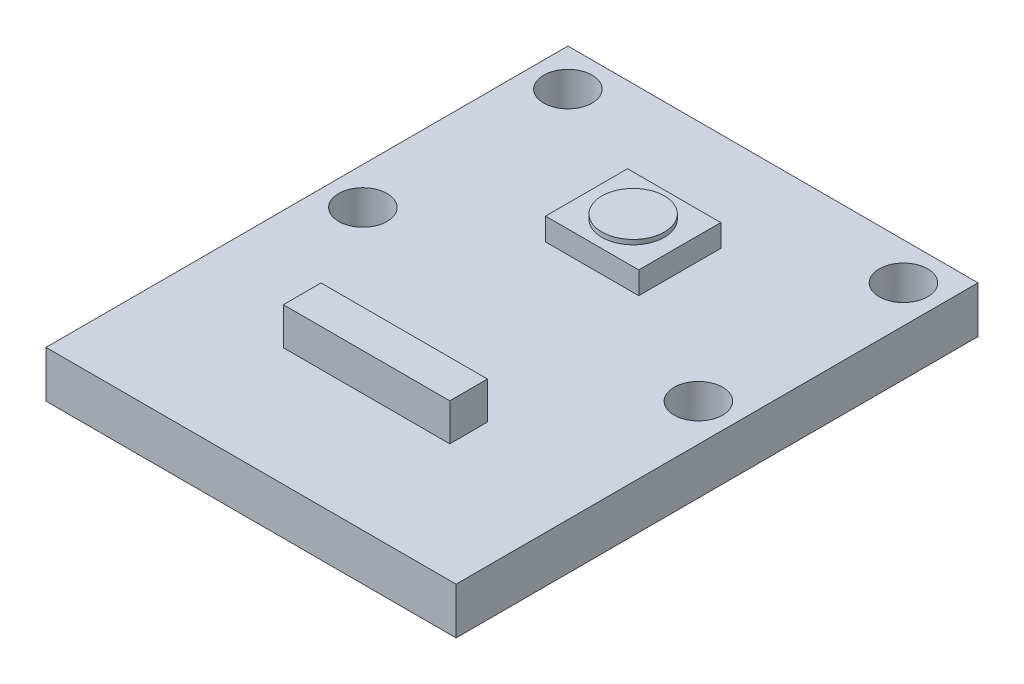
ISO-10303-21;
HEADER;
FILE_DESCRIPTION(('STEP AP214'),'2;1');
FILE_NAME('part.step','',(''),(''),'','','');
FILE_SCHEMA(('AUTOMOTIVE_DESIGN { 1 0 10303 214 1 1 1 1 }'));
ENDSEC;
DATA;
#1=APPLICATION_CONTEXT('core data for automotive mechanical design processes');
#2=APPLICATION_PROTOCOL_DEFINITION('international standard','automotive_design',2000,#1);
#3=PRODUCT_CONTEXT('',#1,'mechanical');
#4=PRODUCT('Part','Part','',(#3));
#5=PRODUCT_RELATED_PRODUCT_CATEGORY('part','',(#4));
#6=PRODUCT_DEFINITION_FORMATION('','',#4);
#7=PRODUCT_DEFINITION_CONTEXT('part definition',#1,'design');
#8=PRODUCT_DEFINITION('design','',#6,#7);
#9=PRODUCT_DEFINITION_SHAPE('','',#8);
#10=(LENGTH_UNIT() NAMED_UNIT(*) SI_UNIT(.MILLI.,.METRE.));
#11=(NAMED_UNIT(*) PLANE_ANGLE_UNIT() SI_UNIT($,.RADIAN.));
#12=(NAMED_UNIT(*) SI_UNIT($,.STERADIAN.) SOLID_ANGLE_UNIT());
#13=UNCERTAINTY_MEASURE_WITH_UNIT(LENGTH_MEASURE(1.E-05),#10,'distance_accuracy_value','');
#14=(GEOMETRIC_REPRESENTATION_CONTEXT(3) GLOBAL_UNCERTAINTY_ASSIGNED_CONTEXT((#13)) GLOBAL_UNIT_ASSIGNED_CONTEXT((#10,
#11,#12)) REPRESENTATION_CONTEXT('',''));
#15=CARTESIAN_POINT('',(0.,0.,0.));
#16=DIRECTION('',(0.,0.,1.));
#17=DIRECTION('',(1.,0.,0.));
#18=AXIS2_PLACEMENT_3D('',#15,#16,#17);
#19=CARTESIAN_POINT('',(0.,2.5,0.));
#20=DIRECTION('',(0.,-1.,0.));
#21=DIRECTION('',(0.,0.,-1.));
#22=AXIS2_PLACEMENT_3D('',#19,#20,#21);
#23=PLANE('',#22);
#24=DIRECTION('',(0.,0.,-1.));
#25=VECTOR('',#24,1.);
#26=CARTESIAN_POINT('',(2.5,2.5,2.2));
#27=LINE('',#26,#25);
#28=CARTESIAN_POINT('',(2.5,2.5,2.2));
#29=VERTEX_POINT('',#28);
#30=CARTESIAN_POINT('',(2.5,2.5,-2.2));
#31=VERTEX_POINT('',#30);
#32=EDGE_CURVE('E183',#29,#31,#27,.T.);
#33=ORIENTED_EDGE('',*,*,#32,.F.);
#34=DIRECTION('',(1.,0.,0.));
#35=VECTOR('',#34,1.);
#36=CARTESIAN_POINT('',(-2.5,2.5,2.2));
#37=LINE('',#36,#35);
#38=CARTESIAN_POINT('',(-2.5,2.5,2.2));
#39=VERTEX_POINT('',#38);
#40=EDGE_CURVE('E189',#39,#29,#37,.T.);
#41=ORIENTED_EDGE('',*,*,#40,.F.);
#42=DIRECTION('',(0.,0.,1.));
#43=VECTOR('',#42,1.);
#44=CARTESIAN_POINT('',(-2.5,2.5,2.2));
#45=LINE('',#44,#43);
#46=CARTESIAN_POINT('',(-2.5,2.5,-2.2));
#47=VERTEX_POINT('',#46);
#48=EDGE_CURVE('E206',#47,#39,#45,.T.);
#49=ORIENTED_EDGE('',*,*,#48,.F.);
#50=DIRECTION('',(-1.,0.,0.));
#51=VECTOR('',#50,1.);
#52=CARTESIAN_POINT('',(-2.5,2.5,-2.2));
#53=LINE('',#52,#51);
#54=EDGE_CURVE('E202',#31,#47,#53,.T.);
#55=ORIENTED_EDGE('',*,*,#54,.F.);
#56=EDGE_LOOP('',(#33,#41,#49,#55));
#57=FACE_BOUND('',#56,.T.);
#58=CARTESIAN_POINT('',(-9.,2.5,-5.5));
#59=DIRECTION('',(0.,1.,0.));
#60=DIRECTION('',(0.,0.,1.));
#61=AXIS2_PLACEMENT_3D('',#58,#59,#60);
#62=CIRCLE('',#61,1.3);
#63=CARTESIAN_POINT('',(-9.,2.5,-4.2));
#64=VERTEX_POINT('',#63);
#65=EDGE_CURVE('E228',#64,#64,#62,.T.);
#66=ORIENTED_EDGE('',*,*,#65,.F.);
#67=EDGE_LOOP('',(#66));
#68=FACE_BOUND('',#67,.T.);
#69=CARTESIAN_POINT('',(9.,2.5,-5.5));
#70=DIRECTION('',(0.,1.,0.));
#71=DIRECTION('',(0.,0.,1.));
#72=AXIS2_PLACEMENT_3D('',#69,#70,#71);
#73=CIRCLE('',#72,1.3);
#74=CARTESIAN_POINT('',(9.,2.5,-4.2));
#75=VERTEX_POINT('',#74);
#76=EDGE_CURVE('E232',#75,#75,#73,.T.);
#77=ORIENTED_EDGE('',*,*,#76,.F.);
#78=EDGE_LOOP('',(#77));
#79=FACE_BOUND('',#78,.T.);
#80=CARTESIAN_POINT('',(9.,2.5,5.5));
#81=DIRECTION('',(0.,1.,0.));
#82=DIRECTION('',(0.,0.,1.));
#83=AXIS2_PLACEMENT_3D('',#80,#81,#82);
#84=CIRCLE('',#83,1.3);
#85=CARTESIAN_POINT('',(9.,2.5,6.8));
#86=VERTEX_POINT('',#85);
#87=EDGE_CURVE('E237',#86,#86,#84,.T.);
#88=ORIENTED_EDGE('',*,*,#87,.F.);
#89=EDGE_LOOP('',(#88));
#90=FACE_BOUND('',#89,.T.);
#91=CARTESIAN_POINT('',(-9.,2.5,5.5));
#92=DIRECTION('',(0.,1.,0.));
#93=DIRECTION('',(0.,0.,1.));
#94=AXIS2_PLACEMENT_3D('',#91,#92,#93);
#95=CIRCLE('',#94,1.3);
#96=CARTESIAN_POINT('',(-9.,2.5,6.8));
#97=VERTEX_POINT('',#96);
#98=EDGE_CURVE('E242',#97,#97,#95,.T.);
#99=ORIENTED_EDGE('',*,*,#98,.F.);
#100=EDGE_LOOP('',(#99));
#101=FACE_BOUND('',#100,.T.);
#102=DIRECTION('',(0.,0.,-1.));
#103=VECTOR('',#102,1.);
#104=CARTESIAN_POINT('',(11.,2.5,7.5));
#105=LINE('',#104,#103);
#106=CARTESIAN_POINT('',(11.,2.5,20.5));
#107=VERTEX_POINT('',#106);
#108=CARTESIAN_POINT('',(11.,2.5,-7.5));
#109=VERTEX_POINT('',#108);
#110=EDGE_CURVE('E247',#107,#109,#105,.T.);
#111=ORIENTED_EDGE('',*,*,#110,.T.);
#112=DIRECTION('',(-1.,0.,0.));
#113=VECTOR('',#112,1.);
#114=CARTESIAN_POINT('',(-11.,2.5,-7.5));
#115=LINE('',#114,#113);
#116=CARTESIAN_POINT('',(-11.,2.5,-7.5));
#117=VERTEX_POINT('',#116);
#118=EDGE_CURVE('E251',#109,#117,#115,.T.);
#119=ORIENTED_EDGE('',*,*,#118,.T.);
#120=DIRECTION('',(0.,0.,1.));
#121=VECTOR('',#120,1.);
#122=CARTESIAN_POINT('',(-11.,2.5,7.5));
#123=LINE('',#122,#121);
#124=CARTESIAN_POINT('',(-11.,2.5,20.5));
#125=VERTEX_POINT('',#124);
#126=EDGE_CURVE('E255',#117,#125,#123,.T.);
#127=ORIENTED_EDGE('',*,*,#126,.T.);
#128=DIRECTION('',(1.,0.,0.));
#129=VECTOR('',#128,1.);
#130=CARTESIAN_POINT('',(-11.,2.5,20.5));
#131=LINE('',#130,#129);
#132=EDGE_CURVE('E161',#125,#107,#131,.T.);
#133=ORIENTED_EDGE('',*,*,#132,.T.);
#134=EDGE_LOOP('',(#111,#119,#127,#133));
#135=FACE_BOUND('',#134,.T.);
#136=DIRECTION('',(0.,0.,1.));
#137=VECTOR('',#136,1.);
#138=CARTESIAN_POINT('',(-4.61704712291606,2.5,12.1282186002489));
#139=LINE('',#138,#137);
#140=CARTESIAN_POINT('',(-4.61704712291606,2.5,12.1282186002489));
#141=VERTEX_POINT('',#140);
#142=CARTESIAN_POINT('',(-4.61704712291606,2.5,14.1505615549146));
#143=VERTEX_POINT('',#142);
#144=EDGE_CURVE('E159',#141,#143,#139,.T.);
#145=ORIENTED_EDGE('',*,*,#144,.F.);
#146=DIRECTION('',(-1.,0.,0.));
#147=VECTOR('',#146,1.);
#148=CARTESIAN_POINT('',(-4.61704712291606,2.5,12.1282186002489));
#149=LINE('',#148,#147);
#150=CARTESIAN_POINT('',(4.31178780900426,2.5,12.1282186002489));
#151=VERTEX_POINT('',#150);
#152=EDGE_CURVE('E156',#151,#141,#149,.T.);
#153=ORIENTED_EDGE('',*,*,#152,.F.);
#154=DIRECTION('',(0.,0.,-1.));
#155=VECTOR('',#154,1.);
#156=CARTESIAN_POINT('',(4.31178780900426,2.5,12.1282186002489));
#157=LINE('',#156,#155);
#158=CARTESIAN_POINT('',(4.31178780900426,2.5,14.1505615549146));
#159=VERTEX_POINT('',#158);
#160=EDGE_CURVE('E68',#159,#151,#157,.T.);
#161=ORIENTED_EDGE('',*,*,#160,.F.);
#162=DIRECTION('',(1.,0.,0.));
#163=VECTOR('',#162,1.);
#164=CARTESIAN_POINT('',(-4.61704712291606,2.5,14.1505615549146));
#165=LINE('',#164,#163);
#166=EDGE_CURVE('E63',#143,#159,#165,.T.);
#167=ORIENTED_EDGE('',*,*,#166,.F.);
#168=EDGE_LOOP('',(#145,#153,#161,#167));
#169=FACE_BOUND('',#168,.T.);
#170=ADVANCED_FACE('F45',(#57,#68,#79,#90,#101,#135,#169),#23,.F.);
#171=CARTESIAN_POINT('',(11.,2.5,7.5));
#172=DIRECTION('',(-1.,0.,0.));
#173=DIRECTION('',(0.,0.,1.));
#174=AXIS2_PLACEMENT_3D('',#171,#172,#173);
#175=PLANE('',#174);
#176=DIRECTION('',(0.,0.,-1.));
#177=VECTOR('',#176,1.);
#178=CARTESIAN_POINT('',(11.,0.,7.5));
#179=LINE('',#178,#177);
#180=CARTESIAN_POINT('',(11.,0.,20.5));
#181=VERTEX_POINT('',#180);
#182=CARTESIAN_POINT('',(11.,0.,-7.5));
#183=VERTEX_POINT('',#182);
#184=EDGE_CURVE('E259',#181,#183,#179,.T.);
#185=ORIENTED_EDGE('',*,*,#184,.T.);
#186=DIRECTION('',(0.,-1.,0.));
#187=VECTOR('',#186,1.);
#188=CARTESIAN_POINT('',(11.,2.5,-7.5));
#189=LINE('',#188,#187);
#190=EDGE_CURVE('E55',#109,#183,#189,.T.);
#191=ORIENTED_EDGE('',*,*,#190,.F.);
#192=ORIENTED_EDGE('',*,*,#110,.F.);
#193=DIRECTION('',(0.,1.,0.));
#194=VECTOR('',#193,1.);
#195=CARTESIAN_POINT('',(11.,-25.5538646783613,20.5));
#196=LINE('',#195,#194);
#197=EDGE_CURVE('E175',#181,#107,#196,.T.);
#198=ORIENTED_EDGE('',*,*,#197,.F.);
#199=EDGE_LOOP('',(#185,#191,#192,#198));
#200=FACE_BOUND('',#199,.T.);
#201=ADVANCED_FACE('F47',(#200),#175,.F.);
#202=CARTESIAN_POINT('',(-11.,2.5,-7.5));
#203=DIRECTION('',(0.,0.,1.));
#204=DIRECTION('',(1.,0.,0.));
#205=AXIS2_PLACEMENT_3D('',#202,#203,#204);
#206=PLANE('',#205);
#207=DIRECTION('',(-1.,0.,0.));
#208=VECTOR('',#207,1.);
#209=CARTESIAN_POINT('',(-11.,0.,-7.5));
#210=LINE('',#209,#208);
#211=CARTESIAN_POINT('',(-11.,0.,-7.5));
#212=VERTEX_POINT('',#211);
#213=EDGE_CURVE('E263',#183,#212,#210,.T.);
#214=ORIENTED_EDGE('',*,*,#213,.T.);
#215=DIRECTION('',(0.,-1.,0.));
#216=VECTOR('',#215,1.);
#217=CARTESIAN_POINT('',(-11.,2.5,-7.5));
#218=LINE('',#217,#216);
#219=EDGE_CURVE('E258',#117,#212,#218,.T.);
#220=ORIENTED_EDGE('',*,*,#219,.F.);
#221=ORIENTED_EDGE('',*,*,#118,.F.);
#222=ORIENTED_EDGE('',*,*,#190,.T.);
#223=EDGE_LOOP('',(#214,#220,#221,#222));
#224=FACE_BOUND('',#223,.T.);
#225=ADVANCED_FACE('F310',(#224),#206,.F.);
#226=CARTESIAN_POINT('',(-11.,2.5,7.5));
#227=DIRECTION('',(1.,0.,0.));
#228=DIRECTION('',(0.,0.,-1.));
#229=AXIS2_PLACEMENT_3D('',#226,#227,#228);
#230=PLANE('',#229);
#231=DIRECTION('',(0.,0.,1.));
#232=VECTOR('',#231,1.);
#233=CARTESIAN_POINT('',(-11.,0.,7.5));
#234=LINE('',#233,#232);
#235=CARTESIAN_POINT('',(-11.,0.,20.5));
#236=VERTEX_POINT('',#235);
#237=EDGE_CURVE('E252',#212,#236,#234,.T.);
#238=ORIENTED_EDGE('',*,*,#237,.T.);
#239=DIRECTION('',(0.,1.,0.));
#240=VECTOR('',#239,1.);
#241=CARTESIAN_POINT('',(-11.,-25.5538646783613,20.5));
#242=LINE('',#241,#240);
#243=EDGE_CURVE('E179',#236,#125,#242,.T.);
#244=ORIENTED_EDGE('',*,*,#243,.T.);
#245=ORIENTED_EDGE('',*,*,#126,.F.);
#246=ORIENTED_EDGE('',*,*,#219,.T.);
#247=EDGE_LOOP('',(#238,#244,#245,#246));
#248=FACE_BOUND('',#247,.T.);
#249=ADVANCED_FACE('F290',(#248),#230,.F.);
#250=CARTESIAN_POINT('',(0.,0.,0.));
#251=DIRECTION('',(0.,-1.,0.));
#252=DIRECTION('',(0.,0.,-1.));
#253=AXIS2_PLACEMENT_3D('',#250,#251,#252);
#254=PLANE('',#253);
#255=CARTESIAN_POINT('',(-9.,0.,-5.5));
#256=DIRECTION('',(0.,-1.,0.));
#257=DIRECTION('',(0.,0.,-1.));
#258=AXIS2_PLACEMENT_3D('',#255,#256,#257);
#259=CIRCLE('',#258,1.3);
#260=CARTESIAN_POINT('',(-9.,0.,-6.8));
#261=VERTEX_POINT('',#260);
#262=EDGE_CURVE('E49',#261,#261,#259,.T.);
#263=ORIENTED_EDGE('',*,*,#262,.F.);
#264=EDGE_LOOP('',(#263));
#265=FACE_BOUND('',#264,.T.);
#266=CARTESIAN_POINT('',(9.,0.,-5.5));
#267=DIRECTION('',(0.,-1.,0.));
#268=DIRECTION('',(0.,0.,-1.));
#269=AXIS2_PLACEMENT_3D('',#266,#267,#268);
#270=CIRCLE('',#269,1.3);
#271=CARTESIAN_POINT('',(9.,0.,-6.8));
#272=VERTEX_POINT('',#271);
#273=EDGE_CURVE('E236',#272,#272,#270,.T.);
#274=ORIENTED_EDGE('',*,*,#273,.F.);
#275=EDGE_LOOP('',(#274));
#276=FACE_BOUND('',#275,.T.);
#277=CARTESIAN_POINT('',(9.,0.,5.5));
#278=DIRECTION('',(0.,-1.,0.));
#279=DIRECTION('',(0.,0.,-1.));
#280=AXIS2_PLACEMENT_3D('',#277,#278,#279);
#281=CIRCLE('',#280,1.3);
#282=CARTESIAN_POINT('',(9.,0.,4.2));
#283=VERTEX_POINT('',#282);
#284=EDGE_CURVE('E241',#283,#283,#281,.T.);
#285=ORIENTED_EDGE('',*,*,#284,.F.);
#286=EDGE_LOOP('',(#285));
#287=FACE_BOUND('',#286,.T.);
#288=CARTESIAN_POINT('',(-9.,0.,5.5));
#289=DIRECTION('',(0.,-1.,0.));
#290=DIRECTION('',(0.,0.,-1.));
#291=AXIS2_PLACEMENT_3D('',#288,#289,#290);
#292=CIRCLE('',#291,1.3);
#293=CARTESIAN_POINT('',(-9.,0.,4.2));
#294=VERTEX_POINT('',#293);
#295=EDGE_CURVE('E246',#294,#294,#292,.T.);
#296=ORIENTED_EDGE('',*,*,#295,.F.);
#297=EDGE_LOOP('',(#296));
#298=FACE_BOUND('',#297,.T.);
#299=ORIENTED_EDGE('',*,*,#184,.F.);
#300=DIRECTION('',(1.,0.,0.));
#301=VECTOR('',#300,1.);
#302=CARTESIAN_POINT('',(-11.,0.,20.5));
#303=LINE('',#302,#301);
#304=EDGE_CURVE('E166',#236,#181,#303,.T.);
#305=ORIENTED_EDGE('',*,*,#304,.F.);
#306=ORIENTED_EDGE('',*,*,#237,.F.);
#307=ORIENTED_EDGE('',*,*,#213,.F.);
#308=EDGE_LOOP('',(#299,#305,#306,#307));
#309=FACE_BOUND('',#308,.T.);
#310=ADVANCED_FACE('F286',(#265,#276,#287,#298,#309),#254,.T.);
#311=CARTESIAN_POINT('',(-9.,2.5,5.5));
#312=DIRECTION('',(0.,1.,0.));
#313=DIRECTION('',(0.,0.,1.));
#314=AXIS2_PLACEMENT_3D('',#311,#312,#313);
#315=CYLINDRICAL_SURFACE('',#314,1.3);
#316=ORIENTED_EDGE('',*,*,#295,.T.);
#317=EDGE_LOOP('',(#316));
#318=FACE_BOUND('',#317,.T.);
#319=ORIENTED_EDGE('',*,*,#98,.T.);
#320=EDGE_LOOP('',(#319));
#321=FACE_BOUND('',#320,.T.);
#322=ADVANCED_FACE('F289',(#318,#321),#315,.F.);
#323=CARTESIAN_POINT('',(9.,2.5,5.5));
#324=DIRECTION('',(0.,1.,0.));
#325=DIRECTION('',(0.,0.,1.));
#326=AXIS2_PLACEMENT_3D('',#323,#324,#325);
#327=CYLINDRICAL_SURFACE('',#326,1.3);
#328=ORIENTED_EDGE('',*,*,#284,.T.);
#329=EDGE_LOOP('',(#328));
#330=FACE_BOUND('',#329,.T.);
#331=ORIENTED_EDGE('',*,*,#87,.T.);
#332=EDGE_LOOP('',(#331));
#333=FACE_BOUND('',#332,.T.);
#334=ADVANCED_FACE('F379',(#330,#333),#327,.F.);
#335=CARTESIAN_POINT('',(9.,2.5,-5.5));
#336=DIRECTION('',(0.,1.,0.));
#337=DIRECTION('',(0.,0.,1.));
#338=AXIS2_PLACEMENT_3D('',#335,#336,#337);
#339=CYLINDRICAL_SURFACE('',#338,1.3);
#340=ORIENTED_EDGE('',*,*,#273,.T.);
#341=EDGE_LOOP('',(#340));
#342=FACE_BOUND('',#341,.T.);
#343=ORIENTED_EDGE('',*,*,#76,.T.);
#344=EDGE_LOOP('',(#343));
#345=FACE_BOUND('',#344,.T.);
#346=ADVANCED_FACE('F283',(#342,#345),#339,.F.);
#347=CARTESIAN_POINT('',(-9.,2.5,-5.5));
#348=DIRECTION('',(0.,1.,0.));
#349=DIRECTION('',(0.,0.,1.));
#350=AXIS2_PLACEMENT_3D('',#347,#348,#349);
#351=CYLINDRICAL_SURFACE('',#350,1.3);
#352=ORIENTED_EDGE('',*,*,#262,.T.);
#353=EDGE_LOOP('',(#352));
#354=FACE_BOUND('',#353,.T.);
#355=ORIENTED_EDGE('',*,*,#65,.T.);
#356=EDGE_LOOP('',(#355));
#357=FACE_BOUND('',#356,.T.);
#358=ADVANCED_FACE('F500',(#354,#357),#351,.F.);
#359=CARTESIAN_POINT('',(2.5,3.7,2.2));
#360=DIRECTION('',(-1.,0.,0.));
#361=DIRECTION('',(0.,0.,1.));
#362=AXIS2_PLACEMENT_3D('',#359,#360,#361);
#363=PLANE('',#362);
#364=ORIENTED_EDGE('',*,*,#32,.T.);
#365=DIRECTION('',(0.,-1.,0.));
#366=VECTOR('',#365,1.);
#367=CARTESIAN_POINT('',(2.5,3.7,-2.2));
#368=LINE('',#367,#366);
#369=CARTESIAN_POINT('',(2.5,3.7,-2.2));
#370=VERTEX_POINT('',#369);
#371=EDGE_CURVE('E224',#370,#31,#368,.T.);
#372=ORIENTED_EDGE('',*,*,#371,.F.);
#373=DIRECTION('',(0.,0.,-1.));
#374=VECTOR('',#373,1.);
#375=CARTESIAN_POINT('',(2.5,3.7,2.2));
#376=LINE('',#375,#374);
#377=CARTESIAN_POINT('',(2.5,3.7,2.2));
#378=VERTEX_POINT('',#377);
#379=EDGE_CURVE('E184',#378,#370,#376,.T.);
#380=ORIENTED_EDGE('',*,*,#379,.F.);
#381=DIRECTION('',(0.,-1.,0.));
#382=VECTOR('',#381,1.);
#383=CARTESIAN_POINT('',(2.5,3.7,2.2));
#384=LINE('',#383,#382);
#385=EDGE_CURVE('E198',#378,#29,#384,.T.);
#386=ORIENTED_EDGE('',*,*,#385,.T.);
#387=EDGE_LOOP('',(#364,#372,#380,#386));
#388=FACE_BOUND('',#387,.T.);
#389=ADVANCED_FACE('F361',(#388),#363,.F.);
#390=CARTESIAN_POINT('',(-2.5,3.7,-2.2));
#391=DIRECTION('',(0.,0.,1.));
#392=DIRECTION('',(1.,0.,0.));
#393=AXIS2_PLACEMENT_3D('',#390,#391,#392);
#394=PLANE('',#393);
#395=ORIENTED_EDGE('',*,*,#54,.T.);
#396=DIRECTION('',(0.,-1.,0.));
#397=VECTOR('',#396,1.);
#398=CARTESIAN_POINT('',(-2.5,3.7,-2.2));
#399=LINE('',#398,#397);
#400=CARTESIAN_POINT('',(-2.5,3.7,-2.2));
#401=VERTEX_POINT('',#400);
#402=EDGE_CURVE('E220',#401,#47,#399,.T.);
#403=ORIENTED_EDGE('',*,*,#402,.F.);
#404=DIRECTION('',(-1.,0.,0.));
#405=VECTOR('',#404,1.);
#406=CARTESIAN_POINT('',(-2.5,3.7,-2.2));
#407=LINE('',#406,#405);
#408=EDGE_CURVE('E188',#370,#401,#407,.T.);
#409=ORIENTED_EDGE('',*,*,#408,.F.);
#410=ORIENTED_EDGE('',*,*,#371,.T.);
#411=EDGE_LOOP('',(#395,#403,#409,#410));
#412=FACE_BOUND('',#411,.T.);
#413=ADVANCED_FACE('F363',(#412),#394,.F.);
#414=CARTESIAN_POINT('',(-2.5,3.7,2.2));
#415=DIRECTION('',(1.,0.,0.));
#416=DIRECTION('',(0.,0.,-1.));
#417=AXIS2_PLACEMENT_3D('',#414,#415,#416);
#418=PLANE('',#417);
#419=ORIENTED_EDGE('',*,*,#48,.T.);
#420=DIRECTION('',(0.,-1.,0.));
#421=VECTOR('',#420,1.);
#422=CARTESIAN_POINT('',(-2.5,3.7,2.2));
#423=LINE('',#422,#421);
#424=CARTESIAN_POINT('',(-2.5,3.7,2.2));
#425=VERTEX_POINT('',#424);
#426=EDGE_CURVE('E216',#425,#39,#423,.T.);
#427=ORIENTED_EDGE('',*,*,#426,.F.);
#428=DIRECTION('',(0.,0.,1.));
#429=VECTOR('',#428,1.);
#430=CARTESIAN_POINT('',(-2.5,3.7,2.2));
#431=LINE('',#430,#429);
#432=EDGE_CURVE('E192',#401,#425,#431,.T.);
#433=ORIENTED_EDGE('',*,*,#432,.F.);
#434=ORIENTED_EDGE('',*,*,#402,.T.);
#435=EDGE_LOOP('',(#419,#427,#433,#434));
#436=FACE_BOUND('',#435,.T.);
#437=ADVANCED_FACE('F367',(#436),#418,.F.);
#438=CARTESIAN_POINT('',(-2.5,3.7,2.2));
#439=DIRECTION('',(0.,0.,-1.));
#440=DIRECTION('',(-1.,0.,0.));
#441=AXIS2_PLACEMENT_3D('',#438,#439,#440);
#442=PLANE('',#441);
#443=ORIENTED_EDGE('',*,*,#40,.T.);
#444=ORIENTED_EDGE('',*,*,#385,.F.);
#445=DIRECTION('',(1.,0.,0.));
#446=VECTOR('',#445,1.);
#447=CARTESIAN_POINT('',(-2.5,3.7,2.2));
#448=LINE('',#447,#446);
#449=EDGE_CURVE('E195',#425,#378,#448,.T.);
#450=ORIENTED_EDGE('',*,*,#449,.F.);
#451=ORIENTED_EDGE('',*,*,#426,.T.);
#452=EDGE_LOOP('',(#443,#444,#450,#451));
#453=FACE_BOUND('',#452,.T.);
#454=ADVANCED_FACE('F353',(#453),#442,.F.);
#455=CARTESIAN_POINT('',(0.,3.7,0.));
#456=DIRECTION('',(0.,-1.,0.));
#457=DIRECTION('',(0.,0.,-1.));
#458=AXIS2_PLACEMENT_3D('',#455,#456,#457);
#459=PLANE('',#458);
#460=CARTESIAN_POINT('',(0.,3.7,0.));
#461=DIRECTION('',(0.,1.,0.));
#462=DIRECTION('',(0.,0.,1.));
#463=AXIS2_PLACEMENT_3D('',#460,#461,#462);
#464=CIRCLE('',#463,1.67755044523709);
#465=CARTESIAN_POINT('',(0.,3.7,1.67755044523709));
#466=VERTEX_POINT('',#465);
#467=EDGE_CURVE('E11',#466,#466,#464,.T.);
#468=ORIENTED_EDGE('',*,*,#467,.F.);
#469=EDGE_LOOP('',(#468));
#470=FACE_BOUND('',#469,.T.);
#471=ORIENTED_EDGE('',*,*,#379,.T.);
#472=ORIENTED_EDGE('',*,*,#408,.T.);
#473=ORIENTED_EDGE('',*,*,#432,.T.);
#474=ORIENTED_EDGE('',*,*,#449,.T.);
#475=EDGE_LOOP('',(#471,#472,#473,#474));
#476=FACE_BOUND('',#475,.T.);
#477=ADVANCED_FACE('F350',(#470,#476),#459,.F.);
#478=CARTESIAN_POINT('',(-11.,-25.5538646783613,20.5));
#479=DIRECTION('',(0.,0.,1.));
#480=DIRECTION('',(1.,0.,0.));
#481=AXIS2_PLACEMENT_3D('',#478,#479,#480);
#482=PLANE('',#481);
#483=ORIENTED_EDGE('',*,*,#243,.F.);
#484=ORIENTED_EDGE('',*,*,#304,.T.);
#485=ORIENTED_EDGE('',*,*,#197,.T.);
#486=ORIENTED_EDGE('',*,*,#132,.F.);
#487=EDGE_LOOP('',(#483,#484,#485,#486));
#488=FACE_BOUND('',#487,.T.);
#489=ADVANCED_FACE('F305',(#488),#482,.T.);
#490=CARTESIAN_POINT('',(-4.61704712291606,4.5,12.1282186002489));
#491=DIRECTION('',(1.,0.,0.));
#492=DIRECTION('',(0.,0.,-1.));
#493=AXIS2_PLACEMENT_3D('',#490,#491,#492);
#494=PLANE('',#493);
#495=ORIENTED_EDGE('',*,*,#144,.T.);
#496=DIRECTION('',(0.,-1.,0.));
#497=VECTOR('',#496,1.);
#498=CARTESIAN_POINT('',(-4.61704712291606,4.5,14.1505615549146));
#499=LINE('',#498,#497);
#500=CARTESIAN_POINT('',(-4.61704712291606,4.5,14.1505615549146));
#501=VERTEX_POINT('',#500);
#502=EDGE_CURVE('E138',#501,#143,#499,.T.);
#503=ORIENTED_EDGE('',*,*,#502,.F.);
#504=DIRECTION('',(0.,0.,1.));
#505=VECTOR('',#504,1.);
#506=CARTESIAN_POINT('',(-4.61704712291606,4.5,12.1282186002489));
#507=LINE('',#506,#505);
#508=CARTESIAN_POINT('',(-4.61704712291606,4.5,12.1282186002489));
#509=VERTEX_POINT('',#508);
#510=EDGE_CURVE('E146',#509,#501,#507,.T.);
#511=ORIENTED_EDGE('',*,*,#510,.F.);
#512=DIRECTION('',(0.,-1.,0.));
#513=VECTOR('',#512,1.);
#514=CARTESIAN_POINT('',(-4.61704712291606,4.5,12.1282186002489));
#515=LINE('',#514,#513);
#516=EDGE_CURVE('E322',#509,#141,#515,.T.);
#517=ORIENTED_EDGE('',*,*,#516,.T.);
#518=EDGE_LOOP('',(#495,#503,#511,#517));
#519=FACE_BOUND('',#518,.T.);
#520=ADVANCED_FACE('F158',(#519),#494,.F.);
#521=CARTESIAN_POINT('',(-4.61704712291606,4.5,14.1505615549146));
#522=DIRECTION('',(0.,0.,-1.));
#523=DIRECTION('',(-1.,0.,0.));
#524=AXIS2_PLACEMENT_3D('',#521,#522,#523);
#525=PLANE('',#524);
#526=ORIENTED_EDGE('',*,*,#166,.T.);
#527=DIRECTION('',(0.,-1.,0.));
#528=VECTOR('',#527,1.);
#529=CARTESIAN_POINT('',(4.31178780900426,4.5,14.1505615549146));
#530=LINE('',#529,#528);
#531=CARTESIAN_POINT('',(4.31178780900426,4.5,14.1505615549146));
#532=VERTEX_POINT('',#531);
#533=EDGE_CURVE('E141',#532,#159,#530,.T.);
#534=ORIENTED_EDGE('',*,*,#533,.F.);
#535=DIRECTION('',(1.,0.,0.));
#536=VECTOR('',#535,1.);
#537=CARTESIAN_POINT('',(-4.61704712291606,4.5,14.1505615549146));
#538=LINE('',#537,#536);
#539=EDGE_CURVE('E134',#501,#532,#538,.T.);
#540=ORIENTED_EDGE('',*,*,#539,.F.);
#541=ORIENTED_EDGE('',*,*,#502,.T.);
#542=EDGE_LOOP('',(#526,#534,#540,#541));
#543=FACE_BOUND('',#542,.T.);
#544=ADVANCED_FACE('F136',(#543),#525,.F.);
#545=CARTESIAN_POINT('',(4.31178780900426,4.5,12.1282186002489));
#546=DIRECTION('',(-1.,0.,0.));
#547=DIRECTION('',(0.,0.,1.));
#548=AXIS2_PLACEMENT_3D('',#545,#546,#547);
#549=PLANE('',#548);
#550=ORIENTED_EDGE('',*,*,#160,.T.);
#551=DIRECTION('',(0.,-1.,0.));
#552=VECTOR('',#551,1.);
#553=CARTESIAN_POINT('',(4.31178780900426,4.5,12.1282186002489));
#554=LINE('',#553,#552);
#555=CARTESIAN_POINT('',(4.31178780900426,4.5,12.1282186002489));
#556=VERTEX_POINT('',#555);
#557=EDGE_CURVE('E168',#556,#151,#554,.T.);
#558=ORIENTED_EDGE('',*,*,#557,.F.);
#559=DIRECTION('',(0.,0.,-1.));
#560=VECTOR('',#559,1.);
#561=CARTESIAN_POINT('',(4.31178780900426,4.5,12.1282186002489));
#562=LINE('',#561,#560);
#563=EDGE_CURVE('E145',#532,#556,#562,.T.);
#564=ORIENTED_EDGE('',*,*,#563,.F.);
#565=ORIENTED_EDGE('',*,*,#533,.T.);
#566=EDGE_LOOP('',(#550,#558,#564,#565));
#567=FACE_BOUND('',#566,.T.);
#568=ADVANCED_FACE('F426',(#567),#549,.F.);
#569=CARTESIAN_POINT('',(-4.61704712291606,4.5,12.1282186002489));
#570=DIRECTION('',(0.,0.,1.));
#571=DIRECTION('',(1.,0.,0.));
#572=AXIS2_PLACEMENT_3D('',#569,#570,#571);
#573=PLANE('',#572);
#574=ORIENTED_EDGE('',*,*,#152,.T.);
#575=ORIENTED_EDGE('',*,*,#516,.F.);
#576=DIRECTION('',(-1.,0.,0.));
#577=VECTOR('',#576,1.);
#578=CARTESIAN_POINT('',(-4.61704712291606,4.5,12.1282186002489));
#579=LINE('',#578,#577);
#580=EDGE_CURVE('E151',#556,#509,#579,.T.);
#581=ORIENTED_EDGE('',*,*,#580,.F.);
#582=ORIENTED_EDGE('',*,*,#557,.T.);
#583=EDGE_LOOP('',(#574,#575,#581,#582));
#584=FACE_BOUND('',#583,.T.);
#585=ADVANCED_FACE('F321',(#584),#573,.F.);
#586=CARTESIAN_POINT('',(0.,4.5,0.));
#587=DIRECTION('',(0.,1.,0.));
#588=DIRECTION('',(0.,0.,1.));
#589=AXIS2_PLACEMENT_3D('',#586,#587,#588);
#590=PLANE('',#589);
#591=ORIENTED_EDGE('',*,*,#510,.T.);
#592=ORIENTED_EDGE('',*,*,#539,.T.);
#593=ORIENTED_EDGE('',*,*,#563,.T.);
#594=ORIENTED_EDGE('',*,*,#580,.T.);
#595=EDGE_LOOP('',(#591,#592,#593,#594));
#596=FACE_BOUND('',#595,.T.);
#597=ADVANCED_FACE('F149',(#596),#590,.T.);
#598=CARTESIAN_POINT('',(0.,3.95,0.));
#599=DIRECTION('',(0.,-1.,0.));
#600=DIRECTION('',(0.,0.,-1.));
#601=AXIS2_PLACEMENT_3D('',#598,#599,#600);
#602=CYLINDRICAL_SURFACE('',#601,1.67755044523709);
#603=CARTESIAN_POINT('',(0.,3.95,0.));
#604=DIRECTION('',(0.,1.,0.));
#605=DIRECTION('',(0.,0.,1.));
#606=AXIS2_PLACEMENT_3D('',#603,#604,#605);
#607=CIRCLE('',#606,1.67755044523709);
#608=CARTESIAN_POINT('',(0.,3.95,1.67755044523709));
#609=VERTEX_POINT('',#608);
#610=EDGE_CURVE('E317',#609,#609,#607,.T.);
#611=ORIENTED_EDGE('',*,*,#610,.F.);
#612=EDGE_LOOP('',(#611));
#613=FACE_BOUND('',#612,.T.);
#614=ORIENTED_EDGE('',*,*,#467,.T.);
#615=EDGE_LOOP('',(#614));
#616=FACE_BOUND('',#615,.T.);
#617=ADVANCED_FACE('F344',(#613,#616),#602,.T.);
#618=CARTESIAN_POINT('',(0.,3.95,0.));
#619=DIRECTION('',(0.,1.,0.));
#620=DIRECTION('',(0.,0.,1.));
#621=AXIS2_PLACEMENT_3D('',#618,#619,#620);
#622=PLANE('',#621);
#623=ORIENTED_EDGE('',*,*,#610,.T.);
#624=EDGE_LOOP('',(#623));
#625=FACE_BOUND('',#624,.T.);
#626=ADVANCED_FACE('F342',(#625),#622,.T.);
#627=CLOSED_SHELL('',(#170,#201,#225,#249,#310,#322,#334,#346,#358,#389,#413,#437,#454,#477,
#489,#520,#544,#568,#585,#597,#617,#626));
#628=MANIFOLD_SOLID_BREP('B2',#627);
#629=ADVANCED_BREP_SHAPE_REPRESENTATION('',(#18,#628),#14);
#630=SHAPE_DEFINITION_REPRESENTATION(#9,#629);
ENDSEC;
END-ISO-10303-21;
